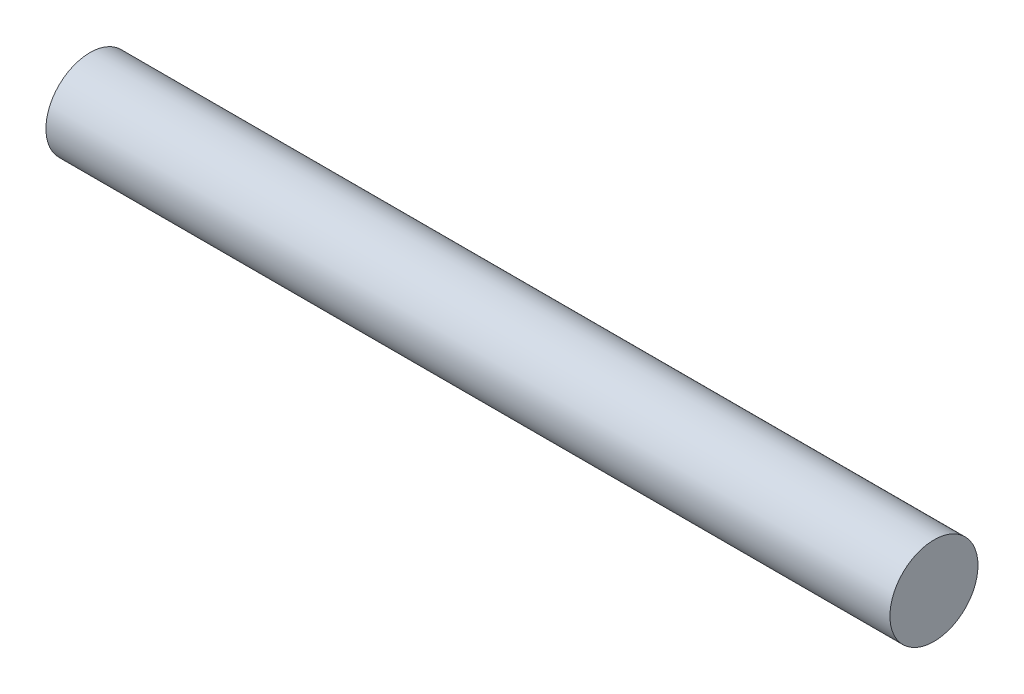
ISO-10303-21;
HEADER;
FILE_DESCRIPTION(('STEP AP214'),'2;1');
FILE_NAME('part.step','',(''),(''),'','','');
FILE_SCHEMA(('AUTOMOTIVE_DESIGN { 1 0 10303 214 1 1 1 1 }'));
ENDSEC;
DATA;
#1=APPLICATION_CONTEXT('core data for automotive mechanical design processes');
#2=APPLICATION_PROTOCOL_DEFINITION('international standard','automotive_design',2000,#1);
#3=PRODUCT_CONTEXT('',#1,'mechanical');
#4=PRODUCT('Part','Part','',(#3));
#5=PRODUCT_RELATED_PRODUCT_CATEGORY('part','',(#4));
#6=PRODUCT_DEFINITION_FORMATION('','',#4);
#7=PRODUCT_DEFINITION_CONTEXT('part definition',#1,'design');
#8=PRODUCT_DEFINITION('design','',#6,#7);
#9=PRODUCT_DEFINITION_SHAPE('','',#8);
#10=(LENGTH_UNIT() NAMED_UNIT(*) SI_UNIT(.MILLI.,.METRE.));
#11=(NAMED_UNIT(*) PLANE_ANGLE_UNIT() SI_UNIT($,.RADIAN.));
#12=(NAMED_UNIT(*) SI_UNIT($,.STERADIAN.) SOLID_ANGLE_UNIT());
#13=UNCERTAINTY_MEASURE_WITH_UNIT(LENGTH_MEASURE(1.E-05),#10,'distance_accuracy_value','');
#14=(GEOMETRIC_REPRESENTATION_CONTEXT(3) GLOBAL_UNCERTAINTY_ASSIGNED_CONTEXT((#13)) GLOBAL_UNIT_ASSIGNED_CONTEXT((#10,
#11,#12)) REPRESENTATION_CONTEXT('',''));
#15=CARTESIAN_POINT('',(0.,0.,0.));
#16=DIRECTION('',(0.,0.,1.));
#17=DIRECTION('',(1.,0.,0.));
#18=AXIS2_PLACEMENT_3D('',#15,#16,#17);
#19=CARTESIAN_POINT('',(23.,0.,0.));
#20=DIRECTION('',(-1.,0.,0.));
#21=DIRECTION('',(0.,0.,1.));
#22=AXIS2_PLACEMENT_3D('',#19,#20,#21);
#23=CYLINDRICAL_SURFACE('',#22,1.2);
#24=CARTESIAN_POINT('',(23.,0.,0.));
#25=DIRECTION('',(1.,0.,0.));
#26=DIRECTION('',(0.,0.,-1.));
#27=AXIS2_PLACEMENT_3D('',#24,#25,#26);
#28=CIRCLE('',#27,1.2);
#29=CARTESIAN_POINT('',(23.,0.,-1.2));
#30=VERTEX_POINT('',#29);
#31=EDGE_CURVE('E10',#30,#30,#28,.T.);
#32=ORIENTED_EDGE('',*,*,#31,.F.);
#33=EDGE_LOOP('',(#32));
#34=FACE_BOUND('',#33,.T.);
#35=CARTESIAN_POINT('',(0.,0.,0.));
#36=DIRECTION('',(1.,0.,0.));
#37=DIRECTION('',(0.,0.,-1.));
#38=AXIS2_PLACEMENT_3D('',#35,#36,#37);
#39=CIRCLE('',#38,1.2);
#40=CARTESIAN_POINT('',(0.,0.,-1.2));
#41=VERTEX_POINT('',#40);
#42=EDGE_CURVE('E33',#41,#41,#39,.T.);
#43=ORIENTED_EDGE('',*,*,#42,.T.);
#44=EDGE_LOOP('',(#43));
#45=FACE_BOUND('',#44,.T.);
#46=ADVANCED_FACE('F30',(#34,#45),#23,.T.);
#47=CARTESIAN_POINT('',(23.,0.,0.));
#48=DIRECTION('',(1.,0.,0.));
#49=DIRECTION('',(0.,0.,-1.));
#50=AXIS2_PLACEMENT_3D('',#47,#48,#49);
#51=PLANE('',#50);
#52=ORIENTED_EDGE('',*,*,#31,.T.);
#53=EDGE_LOOP('',(#52));
#54=FACE_BOUND('',#53,.T.);
#55=ADVANCED_FACE('F45',(#54),#51,.T.);
#56=CARTESIAN_POINT('',(0.,0.,0.));
#57=DIRECTION('',(1.,0.,0.));
#58=DIRECTION('',(0.,0.,-1.));
#59=AXIS2_PLACEMENT_3D('',#56,#57,#58);
#60=PLANE('',#59);
#61=ORIENTED_EDGE('',*,*,#42,.F.);
#62=EDGE_LOOP('',(#61));
#63=FACE_BOUND('',#62,.T.);
#64=ADVANCED_FACE('F43',(#63),#60,.F.);
#65=CLOSED_SHELL('',(#46,#55,#64));
#66=MANIFOLD_SOLID_BREP('B2',#65);
#67=ADVANCED_BREP_SHAPE_REPRESENTATION('',(#18,#66),#14);
#68=SHAPE_DEFINITION_REPRESENTATION(#9,#67);
ENDSEC;
END-ISO-10303-21;
